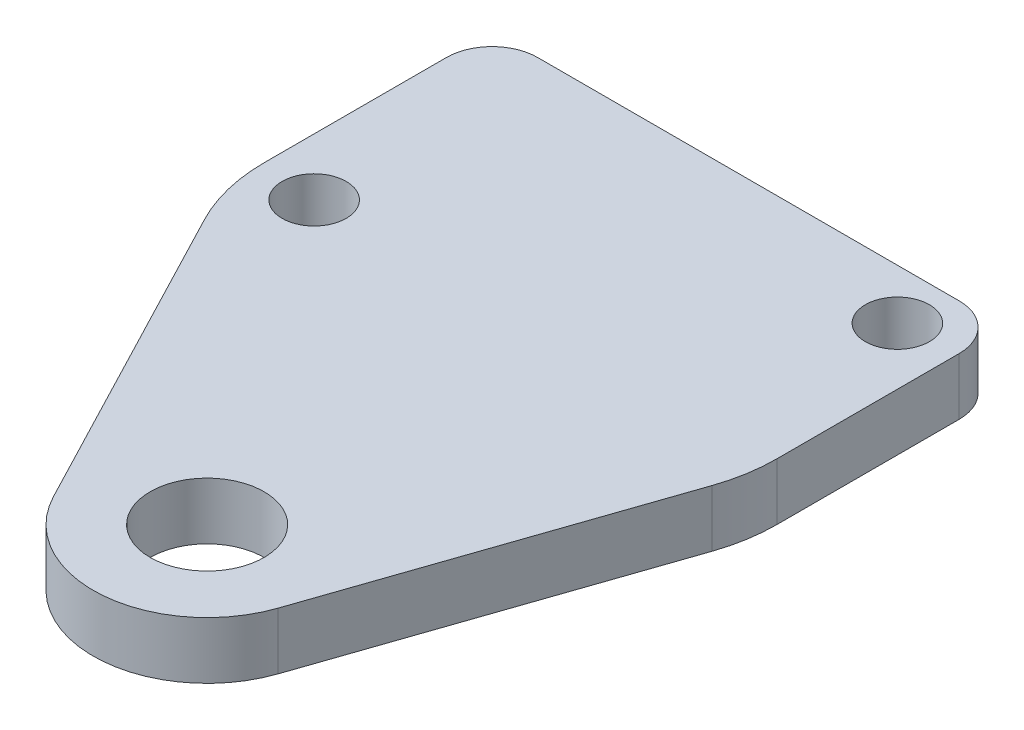
ISO-10303-21;
HEADER;
FILE_DESCRIPTION(('STEP AP214'),'2;1');
FILE_NAME('part.step','',(''),(''),'','','');
FILE_SCHEMA(('AUTOMOTIVE_DESIGN { 1 0 10303 214 1 1 1 1 }'));
ENDSEC;
DATA;
#1=APPLICATION_CONTEXT('core data for automotive mechanical design processes');
#2=APPLICATION_PROTOCOL_DEFINITION('international standard','automotive_design',2000,#1);
#3=PRODUCT_CONTEXT('',#1,'mechanical');
#4=PRODUCT('Part','Part','',(#3));
#5=PRODUCT_RELATED_PRODUCT_CATEGORY('part','',(#4));
#6=PRODUCT_DEFINITION_FORMATION('','',#4);
#7=PRODUCT_DEFINITION_CONTEXT('part definition',#1,'design');
#8=PRODUCT_DEFINITION('design','',#6,#7);
#9=PRODUCT_DEFINITION_SHAPE('','',#8);
#10=(LENGTH_UNIT() NAMED_UNIT(*) SI_UNIT(.MILLI.,.METRE.));
#11=(NAMED_UNIT(*) PLANE_ANGLE_UNIT() SI_UNIT($,.RADIAN.));
#12=(NAMED_UNIT(*) SI_UNIT($,.STERADIAN.) SOLID_ANGLE_UNIT());
#13=UNCERTAINTY_MEASURE_WITH_UNIT(LENGTH_MEASURE(1.E-05),#10,'distance_accuracy_value','');
#14=(GEOMETRIC_REPRESENTATION_CONTEXT(3) GLOBAL_UNCERTAINTY_ASSIGNED_CONTEXT((#13)) GLOBAL_UNIT_ASSIGNED_CONTEXT((#10,
#11,#12)) REPRESENTATION_CONTEXT('',''));
#15=CARTESIAN_POINT('',(0.,0.,0.));
#16=DIRECTION('',(0.,0.,1.));
#17=DIRECTION('',(1.,0.,0.));
#18=AXIS2_PLACEMENT_3D('',#15,#16,#17);
#19=CARTESIAN_POINT('',(-6.35,3.175,-19.05));
#20=DIRECTION('',(0.,1.,0.));
#21=DIRECTION('',(0.,0.,1.));
#22=AXIS2_PLACEMENT_3D('',#19,#20,#21);
#23=PLANE('',#22);
#24=CARTESIAN_POINT('',(9.51250000000002,3.175,-28.95));
#25=DIRECTION('',(0.,1.,0.));
#26=DIRECTION('',(0.,0.,1.));
#27=AXIS2_PLACEMENT_3D('',#24,#25,#26);
#28=CIRCLE('',#27,1.7859375);
#29=CARTESIAN_POINT('',(9.51250000000002,3.175,-27.1640625));
#30=VERTEX_POINT('',#29);
#31=EDGE_CURVE('E223',#30,#30,#28,.T.);
#32=ORIENTED_EDGE('',*,*,#31,.F.);
#33=EDGE_LOOP('',(#32));
#34=FACE_BOUND('',#33,.T.);
#35=CARTESIAN_POINT('',(-12.6875,3.175,-18.65));
#36=DIRECTION('',(0.,1.,0.));
#37=DIRECTION('',(0.,0.,1.));
#38=AXIS2_PLACEMENT_3D('',#35,#36,#37);
#39=CIRCLE('',#38,1.7859375);
#40=CARTESIAN_POINT('',(-12.6875,3.175,-16.8640625));
#41=VERTEX_POINT('',#40);
#42=EDGE_CURVE('E217',#41,#41,#39,.T.);
#43=ORIENTED_EDGE('',*,*,#42,.F.);
#44=EDGE_LOOP('',(#43));
#45=FACE_BOUND('',#44,.T.);
#46=DIRECTION('',(0.,0.,-1.));
#47=VECTOR('',#46,1.);
#48=CARTESIAN_POINT('',(12.7,3.175,-31.75));
#49=LINE('',#48,#47);
#50=CARTESIAN_POINT('',(12.7,3.175,-19.05));
#51=VERTEX_POINT('',#50);
#52=CARTESIAN_POINT('',(12.7,3.175,-29.21));
#53=VERTEX_POINT('',#52);
#54=EDGE_CURVE('E151',#51,#53,#49,.T.);
#55=ORIENTED_EDGE('',*,*,#54,.T.);
#56=CARTESIAN_POINT('',(10.16,3.175,-29.21));
#57=DIRECTION('',(0.,1.,0.));
#58=DIRECTION('',(0.,0.,1.));
#59=AXIS2_PLACEMENT_3D('',#56,#57,#58);
#60=CIRCLE('',#59,2.54);
#61=CARTESIAN_POINT('',(10.16,3.175,-31.75));
#62=VERTEX_POINT('',#61);
#63=EDGE_CURVE('E41',#53,#62,#60,.T.);
#64=ORIENTED_EDGE('',*,*,#63,.T.);
#65=DIRECTION('',(-1.,0.,0.));
#66=VECTOR('',#65,1.);
#67=CARTESIAN_POINT('',(-15.875,3.175,-31.75));
#68=LINE('',#67,#66);
#69=CARTESIAN_POINT('',(-13.335,3.175,-31.75));
#70=VERTEX_POINT('',#69);
#71=EDGE_CURVE('E150',#62,#70,#68,.T.);
#72=ORIENTED_EDGE('',*,*,#71,.T.);
#73=CARTESIAN_POINT('',(-13.335,3.175,-29.21));
#74=DIRECTION('',(0.,1.,0.));
#75=DIRECTION('',(0.,0.,1.));
#76=AXIS2_PLACEMENT_3D('',#73,#74,#75);
#77=CIRCLE('',#76,2.54);
#78=CARTESIAN_POINT('',(-15.875,3.175,-29.21));
#79=VERTEX_POINT('',#78);
#80=EDGE_CURVE('E48',#70,#79,#77,.T.);
#81=ORIENTED_EDGE('',*,*,#80,.T.);
#82=DIRECTION('',(0.,0.,1.));
#83=VECTOR('',#82,1.);
#84=CARTESIAN_POINT('',(-15.875,3.175,-31.75));
#85=LINE('',#84,#83);
#86=CARTESIAN_POINT('',(-15.875,3.175,-19.05));
#87=VERTEX_POINT('',#86);
#88=EDGE_CURVE('E110',#79,#87,#85,.T.);
#89=ORIENTED_EDGE('',*,*,#88,.T.);
#90=CARTESIAN_POINT('',(-6.35,3.175,-19.05));
#91=DIRECTION('',(0.,1.,0.));
#92=DIRECTION('',(0.,0.,1.));
#93=AXIS2_PLACEMENT_3D('',#90,#91,#92);
#94=CIRCLE('',#93,9.525);
#95=CARTESIAN_POINT('',(-14.7962908902117,3.175,-14.6470697032628));
#96=VERTEX_POINT('',#95);
#97=EDGE_CURVE('E113',#87,#96,#94,.T.);
#98=ORIENTED_EDGE('',*,*,#97,.T.);
#99=DIRECTION('',(0.46224989991992,0.,0.886749699759759));
#100=VECTOR('',#99,1.);
#101=CARTESIAN_POINT('',(-14.7962908902117,3.175,-14.6470697032628));
#102=LINE('',#101,#100);
#103=CARTESIAN_POINT('',(-5.63086059347448,3.175,2.93528686449149));
#104=VERTEX_POINT('',#103);
#105=EDGE_CURVE('E127',#96,#104,#102,.T.);
#106=ORIENTED_EDGE('',*,*,#105,.T.);
#107=CARTESIAN_POINT('',(0.,3.175,0.));
#108=DIRECTION('',(0.,1.,0.));
#109=DIRECTION('',(0.,0.,1.));
#110=AXIS2_PLACEMENT_3D('',#107,#108,#109);
#111=CIRCLE('',#110,6.35);
#112=CARTESIAN_POINT('',(6.00675675675676,3.175,2.05945945945946));
#113=VERTEX_POINT('',#112);
#114=EDGE_CURVE('E192',#104,#113,#111,.T.);
#115=ORIENTED_EDGE('',*,*,#114,.T.);
#116=DIRECTION('',(0.324324324324324,0.,-0.945945945945946));
#117=VECTOR('',#116,1.);
#118=CARTESIAN_POINT('',(12.1851351351351,3.175,-15.9608108108108));
#119=LINE('',#118,#117);
#120=CARTESIAN_POINT('',(12.1851351351351,3.175,-15.9608108108108));
#121=VERTEX_POINT('',#120);
#122=EDGE_CURVE('E207',#113,#121,#119,.T.);
#123=ORIENTED_EDGE('',*,*,#122,.T.);
#124=CARTESIAN_POINT('',(3.175,3.175,-19.05));
#125=DIRECTION('',(0.,1.,0.));
#126=DIRECTION('',(0.,0.,-1.));
#127=AXIS2_PLACEMENT_3D('',#124,#125,#126);
#128=CIRCLE('',#127,9.525);
#129=EDGE_CURVE('E205',#121,#51,#128,.T.);
#130=ORIENTED_EDGE('',*,*,#129,.T.);
#131=EDGE_LOOP('',(#55,#64,#72,#81,#89,#98,#106,#115,#123,#130));
#132=FACE_BOUND('',#131,.T.);
#133=CARTESIAN_POINT('',(0.,3.175,0.));
#134=DIRECTION('',(0.,1.,0.));
#135=DIRECTION('',(0.,0.,1.));
#136=AXIS2_PLACEMENT_3D('',#133,#134,#135);
#137=CIRCLE('',#136,3.175);
#138=CARTESIAN_POINT('',(0.,3.175,3.175));
#139=VERTEX_POINT('',#138);
#140=EDGE_CURVE('E202',#139,#139,#137,.T.);
#141=ORIENTED_EDGE('',*,*,#140,.F.);
#142=EDGE_LOOP('',(#141));
#143=FACE_BOUND('',#142,.T.);
#144=ADVANCED_FACE('F33',(#34,#45,#132,#143),#23,.T.);
#145=CARTESIAN_POINT('',(-6.35,0.,-19.05));
#146=DIRECTION('',(0.,1.,0.));
#147=DIRECTION('',(0.,0.,1.));
#148=AXIS2_PLACEMENT_3D('',#145,#146,#147);
#149=PLANE('',#148);
#150=CARTESIAN_POINT('',(9.51250000000002,0.,-28.95));
#151=DIRECTION('',(0.,1.,0.));
#152=DIRECTION('',(0.,0.,1.));
#153=AXIS2_PLACEMENT_3D('',#150,#151,#152);
#154=CIRCLE('',#153,1.7859375);
#155=CARTESIAN_POINT('',(9.51250000000002,0.,-27.1640625));
#156=VERTEX_POINT('',#155);
#157=EDGE_CURVE('E220',#156,#156,#154,.T.);
#158=ORIENTED_EDGE('',*,*,#157,.T.);
#159=EDGE_LOOP('',(#158));
#160=FACE_BOUND('',#159,.T.);
#161=CARTESIAN_POINT('',(-12.6875,0.,-18.65));
#162=DIRECTION('',(0.,1.,0.));
#163=DIRECTION('',(0.,0.,1.));
#164=AXIS2_PLACEMENT_3D('',#161,#162,#163);
#165=CIRCLE('',#164,1.7859375);
#166=CARTESIAN_POINT('',(-12.6875,0.,-16.8640625));
#167=VERTEX_POINT('',#166);
#168=EDGE_CURVE('E214',#167,#167,#165,.T.);
#169=ORIENTED_EDGE('',*,*,#168,.T.);
#170=EDGE_LOOP('',(#169));
#171=FACE_BOUND('',#170,.T.);
#172=DIRECTION('',(-1.,0.,0.));
#173=VECTOR('',#172,1.);
#174=CARTESIAN_POINT('',(-15.875,0.,-31.75));
#175=LINE('',#174,#173);
#176=CARTESIAN_POINT('',(10.16,0.,-31.75));
#177=VERTEX_POINT('',#176);
#178=CARTESIAN_POINT('',(-13.335,0.,-31.75));
#179=VERTEX_POINT('',#178);
#180=EDGE_CURVE('E118',#177,#179,#175,.T.);
#181=ORIENTED_EDGE('',*,*,#180,.F.);
#182=CARTESIAN_POINT('',(10.16,0.,-29.21));
#183=DIRECTION('',(0.,1.,0.));
#184=DIRECTION('',(0.,0.,1.));
#185=AXIS2_PLACEMENT_3D('',#182,#183,#184);
#186=CIRCLE('',#185,2.54);
#187=CARTESIAN_POINT('',(12.7,0.,-29.21));
#188=VERTEX_POINT('',#187);
#189=EDGE_CURVE('E145',#177,#188,#186,.F.);
#190=ORIENTED_EDGE('',*,*,#189,.T.);
#191=DIRECTION('',(0.,0.,-1.));
#192=VECTOR('',#191,1.);
#193=CARTESIAN_POINT('',(12.7,0.,-31.75));
#194=LINE('',#193,#192);
#195=CARTESIAN_POINT('',(12.7,0.,-19.05));
#196=VERTEX_POINT('',#195);
#197=EDGE_CURVE('E167',#196,#188,#194,.T.);
#198=ORIENTED_EDGE('',*,*,#197,.F.);
#199=CARTESIAN_POINT('',(3.175,0.,-19.05));
#200=DIRECTION('',(0.,1.,0.));
#201=DIRECTION('',(0.,0.,-1.));
#202=AXIS2_PLACEMENT_3D('',#199,#200,#201);
#203=CIRCLE('',#202,9.525);
#204=CARTESIAN_POINT('',(12.1851351351351,0.,-15.9608108108108));
#205=VERTEX_POINT('',#204);
#206=EDGE_CURVE('E171',#205,#196,#203,.T.);
#207=ORIENTED_EDGE('',*,*,#206,.F.);
#208=DIRECTION('',(0.324324324324324,0.,-0.945945945945946));
#209=VECTOR('',#208,1.);
#210=CARTESIAN_POINT('',(12.1851351351351,0.,-15.9608108108108));
#211=LINE('',#210,#209);
#212=CARTESIAN_POINT('',(6.00675675675676,0.,2.05945945945946));
#213=VERTEX_POINT('',#212);
#214=EDGE_CURVE('E174',#213,#205,#211,.T.);
#215=ORIENTED_EDGE('',*,*,#214,.F.);
#216=CARTESIAN_POINT('',(0.,0.,0.));
#217=DIRECTION('',(0.,1.,0.));
#218=DIRECTION('',(0.,0.,1.));
#219=AXIS2_PLACEMENT_3D('',#216,#217,#218);
#220=CIRCLE('',#219,6.35);
#221=CARTESIAN_POINT('',(-5.63086059347448,0.,2.93528686449149));
#222=VERTEX_POINT('',#221);
#223=EDGE_CURVE('E191',#222,#213,#220,.T.);
#224=ORIENTED_EDGE('',*,*,#223,.F.);
#225=DIRECTION('',(0.46224989991992,0.,0.886749699759759));
#226=VECTOR('',#225,1.);
#227=CARTESIAN_POINT('',(-14.7962908902117,0.,-14.6470697032628));
#228=LINE('',#227,#226);
#229=CARTESIAN_POINT('',(-14.7962908902117,0.,-14.6470697032628));
#230=VERTEX_POINT('',#229);
#231=EDGE_CURVE('E196',#230,#222,#228,.T.);
#232=ORIENTED_EDGE('',*,*,#231,.F.);
#233=CARTESIAN_POINT('',(-6.35,0.,-19.05));
#234=DIRECTION('',(0.,1.,0.));
#235=DIRECTION('',(0.,0.,1.));
#236=AXIS2_PLACEMENT_3D('',#233,#234,#235);
#237=CIRCLE('',#236,9.525);
#238=CARTESIAN_POINT('',(-15.875,0.,-19.05));
#239=VERTEX_POINT('',#238);
#240=EDGE_CURVE('E198',#239,#230,#237,.T.);
#241=ORIENTED_EDGE('',*,*,#240,.F.);
#242=DIRECTION('',(0.,0.,1.));
#243=VECTOR('',#242,1.);
#244=CARTESIAN_POINT('',(-15.875,0.,-31.75));
#245=LINE('',#244,#243);
#246=CARTESIAN_POINT('',(-15.875,0.,-29.21));
#247=VERTEX_POINT('',#246);
#248=EDGE_CURVE('E131',#247,#239,#245,.T.);
#249=ORIENTED_EDGE('',*,*,#248,.F.);
#250=CARTESIAN_POINT('',(-13.335,0.,-29.21));
#251=DIRECTION('',(0.,1.,0.));
#252=DIRECTION('',(0.,0.,1.));
#253=AXIS2_PLACEMENT_3D('',#250,#251,#252);
#254=CIRCLE('',#253,2.54);
#255=EDGE_CURVE('E143',#247,#179,#254,.F.);
#256=ORIENTED_EDGE('',*,*,#255,.T.);
#257=EDGE_LOOP('',(#181,#190,#198,#207,#215,#224,#232,#241,#249,#256));
#258=FACE_BOUND('',#257,.T.);
#259=CARTESIAN_POINT('',(0.,0.,0.));
#260=DIRECTION('',(0.,1.,0.));
#261=DIRECTION('',(0.,0.,1.));
#262=AXIS2_PLACEMENT_3D('',#259,#260,#261);
#263=CIRCLE('',#262,3.175);
#264=CARTESIAN_POINT('',(0.,0.,3.175));
#265=VERTEX_POINT('',#264);
#266=EDGE_CURVE('E211',#265,#265,#263,.T.);
#267=ORIENTED_EDGE('',*,*,#266,.T.);
#268=EDGE_LOOP('',(#267));
#269=FACE_BOUND('',#268,.T.);
#270=ADVANCED_FACE('F164',(#160,#171,#258,#269),#149,.F.);
#271=CARTESIAN_POINT('',(-15.875,3.175,-31.75));
#272=DIRECTION('',(1.,0.,0.));
#273=DIRECTION('',(0.,0.,-1.));
#274=AXIS2_PLACEMENT_3D('',#271,#272,#273);
#275=PLANE('',#274);
#276=ORIENTED_EDGE('',*,*,#88,.F.);
#277=DIRECTION('',(0.,-1.,0.));
#278=VECTOR('',#277,1.);
#279=CARTESIAN_POINT('',(-15.875,3.175,-29.21));
#280=LINE('',#279,#278);
#281=EDGE_CURVE('E11',#79,#247,#280,.T.);
#282=ORIENTED_EDGE('',*,*,#281,.T.);
#283=ORIENTED_EDGE('',*,*,#248,.T.);
#284=DIRECTION('',(0.,-1.,0.));
#285=VECTOR('',#284,1.);
#286=CARTESIAN_POINT('',(-15.875,3.175,-19.05));
#287=LINE('',#286,#285);
#288=EDGE_CURVE('E123',#87,#239,#287,.T.);
#289=ORIENTED_EDGE('',*,*,#288,.F.);
#290=EDGE_LOOP('',(#276,#282,#283,#289));
#291=FACE_BOUND('',#290,.T.);
#292=ADVANCED_FACE('F129',(#291),#275,.F.);
#293=CARTESIAN_POINT('',(-6.35,3.175,-19.05));
#294=DIRECTION('',(0.,-1.,0.));
#295=DIRECTION('',(0.,0.,-1.));
#296=AXIS2_PLACEMENT_3D('',#293,#294,#295);
#297=CYLINDRICAL_SURFACE('',#296,9.525);
#298=ORIENTED_EDGE('',*,*,#240,.T.);
#299=DIRECTION('',(0.,-1.,0.));
#300=VECTOR('',#299,1.);
#301=CARTESIAN_POINT('',(-14.7962908902117,3.175,-14.6470697032628));
#302=LINE('',#301,#300);
#303=EDGE_CURVE('E125',#96,#230,#302,.T.);
#304=ORIENTED_EDGE('',*,*,#303,.F.);
#305=ORIENTED_EDGE('',*,*,#97,.F.);
#306=ORIENTED_EDGE('',*,*,#288,.T.);
#307=EDGE_LOOP('',(#298,#304,#305,#306));
#308=FACE_BOUND('',#307,.T.);
#309=ADVANCED_FACE('F122',(#308),#297,.T.);
#310=CARTESIAN_POINT('',(-14.7962908902117,3.175,-14.6470697032628));
#311=DIRECTION('',(0.886749699759759,0.,-0.46224989991992));
#312=DIRECTION('',(-0.46224989991992,0.,-0.88674969975976));
#313=AXIS2_PLACEMENT_3D('',#310,#311,#312);
#314=PLANE('',#313);
#315=ORIENTED_EDGE('',*,*,#231,.T.);
#316=DIRECTION('',(0.,-1.,0.));
#317=VECTOR('',#316,1.);
#318=CARTESIAN_POINT('',(-5.63086059347448,3.175,2.93528686449149));
#319=LINE('',#318,#317);
#320=EDGE_CURVE('E137',#104,#222,#319,.T.);
#321=ORIENTED_EDGE('',*,*,#320,.F.);
#322=ORIENTED_EDGE('',*,*,#105,.F.);
#323=ORIENTED_EDGE('',*,*,#303,.T.);
#324=EDGE_LOOP('',(#315,#321,#322,#323));
#325=FACE_BOUND('',#324,.T.);
#326=ADVANCED_FACE('F270',(#325),#314,.F.);
#327=CARTESIAN_POINT('',(0.,3.175,0.));
#328=DIRECTION('',(0.,-1.,0.));
#329=DIRECTION('',(0.,0.,-1.));
#330=AXIS2_PLACEMENT_3D('',#327,#328,#329);
#331=CYLINDRICAL_SURFACE('',#330,6.35);
#332=ORIENTED_EDGE('',*,*,#223,.T.);
#333=DIRECTION('',(0.,-1.,0.));
#334=VECTOR('',#333,1.);
#335=CARTESIAN_POINT('',(6.00675675675676,3.175,2.05945945945946));
#336=LINE('',#335,#334);
#337=EDGE_CURVE('E182',#113,#213,#336,.T.);
#338=ORIENTED_EDGE('',*,*,#337,.F.);
#339=ORIENTED_EDGE('',*,*,#114,.F.);
#340=ORIENTED_EDGE('',*,*,#320,.T.);
#341=EDGE_LOOP('',(#332,#338,#339,#340));
#342=FACE_BOUND('',#341,.T.);
#343=ADVANCED_FACE('F189',(#342),#331,.T.);
#344=CARTESIAN_POINT('',(12.1851351351351,3.175,-15.9608108108108));
#345=DIRECTION('',(-0.945945945945946,0.,-0.324324324324324));
#346=DIRECTION('',(-0.324324324324324,0.,0.945945945945946));
#347=AXIS2_PLACEMENT_3D('',#344,#345,#346);
#348=PLANE('',#347);
#349=ORIENTED_EDGE('',*,*,#214,.T.);
#350=DIRECTION('',(0.,-1.,0.));
#351=VECTOR('',#350,1.);
#352=CARTESIAN_POINT('',(12.1851351351351,3.175,-15.9608108108108));
#353=LINE('',#352,#351);
#354=EDGE_CURVE('E179',#121,#205,#353,.T.);
#355=ORIENTED_EDGE('',*,*,#354,.F.);
#356=ORIENTED_EDGE('',*,*,#122,.F.);
#357=ORIENTED_EDGE('',*,*,#337,.T.);
#358=EDGE_LOOP('',(#349,#355,#356,#357));
#359=FACE_BOUND('',#358,.T.);
#360=ADVANCED_FACE('F263',(#359),#348,.F.);
#361=CARTESIAN_POINT('',(3.175,3.175,-19.05));
#362=DIRECTION('',(0.,-1.,0.));
#363=DIRECTION('',(0.,0.,-1.));
#364=AXIS2_PLACEMENT_3D('',#361,#362,#363);
#365=CYLINDRICAL_SURFACE('',#364,9.525);
#366=ORIENTED_EDGE('',*,*,#206,.T.);
#367=DIRECTION('',(0.,-1.,0.));
#368=VECTOR('',#367,1.);
#369=CARTESIAN_POINT('',(12.7,3.175,-19.05));
#370=LINE('',#369,#368);
#371=EDGE_CURVE('E159',#51,#196,#370,.T.);
#372=ORIENTED_EDGE('',*,*,#371,.F.);
#373=ORIENTED_EDGE('',*,*,#129,.F.);
#374=ORIENTED_EDGE('',*,*,#354,.T.);
#375=EDGE_LOOP('',(#366,#372,#373,#374));
#376=FACE_BOUND('',#375,.T.);
#377=ADVANCED_FACE('F260',(#376),#365,.T.);
#378=CARTESIAN_POINT('',(12.7,3.175,-31.75));
#379=DIRECTION('',(-1.,0.,0.));
#380=DIRECTION('',(0.,0.,1.));
#381=AXIS2_PLACEMENT_3D('',#378,#379,#380);
#382=PLANE('',#381);
#383=ORIENTED_EDGE('',*,*,#197,.T.);
#384=DIRECTION('',(0.,-1.,0.));
#385=VECTOR('',#384,1.);
#386=CARTESIAN_POINT('',(12.7,3.175,-29.21));
#387=LINE('',#386,#385);
#388=EDGE_CURVE('E56',#188,#53,#387,.F.);
#389=ORIENTED_EDGE('',*,*,#388,.T.);
#390=ORIENTED_EDGE('',*,*,#54,.F.);
#391=ORIENTED_EDGE('',*,*,#371,.T.);
#392=EDGE_LOOP('',(#383,#389,#390,#391));
#393=FACE_BOUND('',#392,.T.);
#394=ADVANCED_FACE('F169',(#393),#382,.F.);
#395=CARTESIAN_POINT('',(-15.875,3.175,-31.75));
#396=DIRECTION('',(0.,0.,1.));
#397=DIRECTION('',(1.,0.,0.));
#398=AXIS2_PLACEMENT_3D('',#395,#396,#397);
#399=PLANE('',#398);
#400=ORIENTED_EDGE('',*,*,#71,.F.);
#401=DIRECTION('',(0.,-1.,0.));
#402=VECTOR('',#401,1.);
#403=CARTESIAN_POINT('',(10.16,3.175,-31.75));
#404=LINE('',#403,#402);
#405=EDGE_CURVE('E135',#62,#177,#404,.T.);
#406=ORIENTED_EDGE('',*,*,#405,.T.);
#407=ORIENTED_EDGE('',*,*,#180,.T.);
#408=DIRECTION('',(0.,-1.,0.));
#409=VECTOR('',#408,1.);
#410=CARTESIAN_POINT('',(-13.335,3.175,-31.75));
#411=LINE('',#410,#409);
#412=EDGE_CURVE('E133',#179,#70,#411,.F.);
#413=ORIENTED_EDGE('',*,*,#412,.T.);
#414=EDGE_LOOP('',(#400,#406,#407,#413));
#415=FACE_BOUND('',#414,.T.);
#416=ADVANCED_FACE('F155',(#415),#399,.F.);
#417=CARTESIAN_POINT('',(0.,3.175,0.));
#418=DIRECTION('',(0.,-1.,0.));
#419=DIRECTION('',(0.,0.,-1.));
#420=AXIS2_PLACEMENT_3D('',#417,#418,#419);
#421=CYLINDRICAL_SURFACE('',#420,3.175);
#422=ORIENTED_EDGE('',*,*,#140,.T.);
#423=EDGE_LOOP('',(#422));
#424=FACE_BOUND('',#423,.T.);
#425=ORIENTED_EDGE('',*,*,#266,.F.);
#426=EDGE_LOOP('',(#425));
#427=FACE_BOUND('',#426,.T.);
#428=ADVANCED_FACE('F244',(#424,#427),#421,.F.);
#429=CARTESIAN_POINT('',(-12.6875,0.,-18.65));
#430=DIRECTION('',(0.,1.,0.));
#431=DIRECTION('',(0.,0.,1.));
#432=AXIS2_PLACEMENT_3D('',#429,#430,#431);
#433=CYLINDRICAL_SURFACE('',#432,1.7859375);
#434=ORIENTED_EDGE('',*,*,#168,.F.);
#435=EDGE_LOOP('',(#434));
#436=FACE_BOUND('',#435,.T.);
#437=ORIENTED_EDGE('',*,*,#42,.T.);
#438=EDGE_LOOP('',(#437));
#439=FACE_BOUND('',#438,.T.);
#440=ADVANCED_FACE('F234',(#436,#439),#433,.F.);
#441=CARTESIAN_POINT('',(9.51250000000002,0.,-28.95));
#442=DIRECTION('',(0.,1.,0.));
#443=DIRECTION('',(0.,0.,1.));
#444=AXIS2_PLACEMENT_3D('',#441,#442,#443);
#445=CYLINDRICAL_SURFACE('',#444,1.7859375);
#446=ORIENTED_EDGE('',*,*,#157,.F.);
#447=EDGE_LOOP('',(#446));
#448=FACE_BOUND('',#447,.T.);
#449=ORIENTED_EDGE('',*,*,#31,.T.);
#450=EDGE_LOOP('',(#449));
#451=FACE_BOUND('',#450,.T.);
#452=ADVANCED_FACE('F231',(#448,#451),#445,.F.);
#453=CARTESIAN_POINT('',(10.16,3.175,-29.21));
#454=DIRECTION('',(0.,-1.,0.));
#455=DIRECTION('',(0.,0.,-1.));
#456=AXIS2_PLACEMENT_3D('',#453,#454,#455);
#457=CYLINDRICAL_SURFACE('',#456,2.54);
#458=ORIENTED_EDGE('',*,*,#63,.F.);
#459=ORIENTED_EDGE('',*,*,#388,.F.);
#460=ORIENTED_EDGE('',*,*,#189,.F.);
#461=ORIENTED_EDGE('',*,*,#405,.F.);
#462=EDGE_LOOP('',(#458,#459,#460,#461));
#463=FACE_BOUND('',#462,.T.);
#464=ADVANCED_FACE('F161',(#463),#457,.T.);
#465=CARTESIAN_POINT('',(-13.335,3.175,-29.21));
#466=DIRECTION('',(0.,-1.,0.));
#467=DIRECTION('',(0.,0.,-1.));
#468=AXIS2_PLACEMENT_3D('',#465,#466,#467);
#469=CYLINDRICAL_SURFACE('',#468,2.54);
#470=ORIENTED_EDGE('',*,*,#80,.F.);
#471=ORIENTED_EDGE('',*,*,#412,.F.);
#472=ORIENTED_EDGE('',*,*,#255,.F.);
#473=ORIENTED_EDGE('',*,*,#281,.F.);
#474=EDGE_LOOP('',(#470,#471,#472,#473));
#475=FACE_BOUND('',#474,.T.);
#476=ADVANCED_FACE('F35',(#475),#469,.T.);
#477=CLOSED_SHELL('',(#144,#270,#292,#309,#326,#343,#360,#377,#394,#416,#428,#440,#452,#464,#476));
#478=MANIFOLD_SOLID_BREP('B2',#477);
#479=ADVANCED_BREP_SHAPE_REPRESENTATION('',(#18,#478),#14);
#480=SHAPE_DEFINITION_REPRESENTATION(#9,#479);
ENDSEC;
END-ISO-10303-21;
